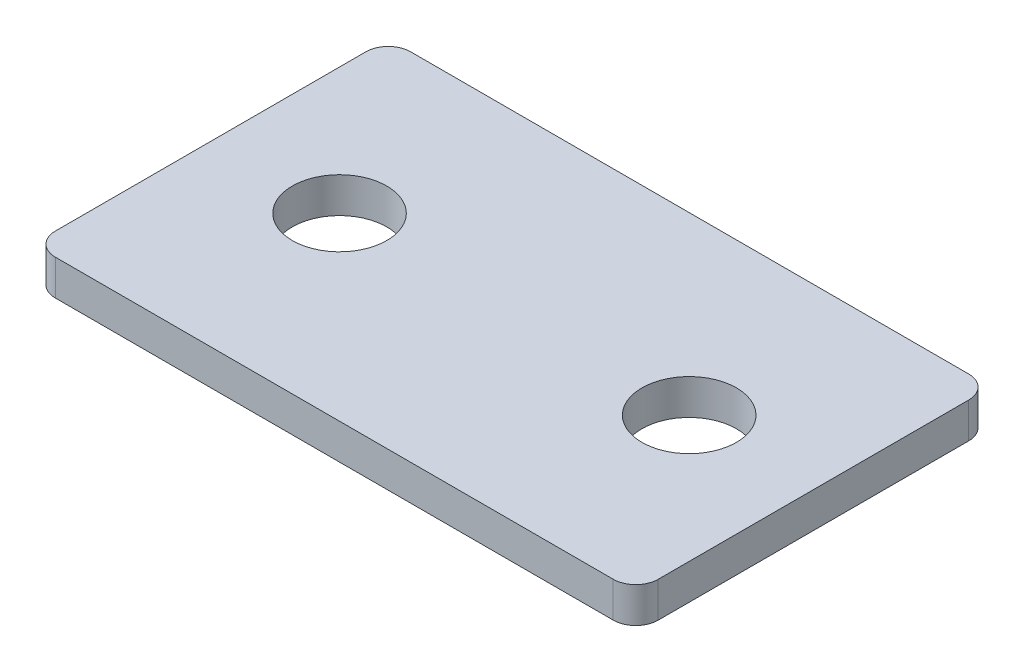
ISO-10303-21;
HEADER;
FILE_DESCRIPTION(('STEP AP214'),'2;1');
FILE_NAME('part.step','',(''),(''),'','','');
FILE_SCHEMA(('AUTOMOTIVE_DESIGN { 1 0 10303 214 1 1 1 1 }'));
ENDSEC;
DATA;
#1=APPLICATION_CONTEXT('core data for automotive mechanical design processes');
#2=APPLICATION_PROTOCOL_DEFINITION('international standard','automotive_design',2000,#1);
#3=PRODUCT_CONTEXT('',#1,'mechanical');
#4=PRODUCT('Part','Part','',(#3));
#5=PRODUCT_RELATED_PRODUCT_CATEGORY('part','',(#4));
#6=PRODUCT_DEFINITION_FORMATION('','',#4);
#7=PRODUCT_DEFINITION_CONTEXT('part definition',#1,'design');
#8=PRODUCT_DEFINITION('design','',#6,#7);
#9=PRODUCT_DEFINITION_SHAPE('','',#8);
#10=(LENGTH_UNIT() NAMED_UNIT(*) SI_UNIT(.MILLI.,.METRE.));
#11=(NAMED_UNIT(*) PLANE_ANGLE_UNIT() SI_UNIT($,.RADIAN.));
#12=(NAMED_UNIT(*) SI_UNIT($,.STERADIAN.) SOLID_ANGLE_UNIT());
#13=UNCERTAINTY_MEASURE_WITH_UNIT(LENGTH_MEASURE(1.E-05),#10,'distance_accuracy_value','');
#14=(GEOMETRIC_REPRESENTATION_CONTEXT(3) GLOBAL_UNCERTAINTY_ASSIGNED_CONTEXT((#13)) GLOBAL_UNIT_ASSIGNED_CONTEXT((#10,
#11,#12)) REPRESENTATION_CONTEXT('',''));
#15=CARTESIAN_POINT('',(0.,0.,0.));
#16=DIRECTION('',(0.,0.,1.));
#17=DIRECTION('',(1.,0.,0.));
#18=AXIS2_PLACEMENT_3D('',#15,#16,#17);
#19=CARTESIAN_POINT('',(-15.748,2.,8.76300000000001));
#20=DIRECTION('',(0.,1.,0.));
#21=DIRECTION('',(0.,0.,1.));
#22=AXIS2_PLACEMENT_3D('',#19,#20,#21);
#23=PLANE('',#22);
#24=CARTESIAN_POINT('',(-9.868,2.,-0.132999999999999));
#25=DIRECTION('',(0.,1.,0.));
#26=DIRECTION('',(0.,0.,1.));
#27=AXIS2_PLACEMENT_3D('',#24,#25,#26);
#28=CIRCLE('',#27,2.667);
#29=CARTESIAN_POINT('',(-9.868,2.,2.534));
#30=VERTEX_POINT('',#29);
#31=EDGE_CURVE('E134',#30,#30,#28,.T.);
#32=ORIENTED_EDGE('',*,*,#31,.F.);
#33=EDGE_LOOP('',(#32));
#34=FACE_BOUND('',#33,.T.);
#35=CARTESIAN_POINT('',(-15.748,2.,8.76300000000001));
#36=DIRECTION('',(0.,1.,0.));
#37=DIRECTION('',(0.,0.,1.));
#38=AXIS2_PLACEMENT_3D('',#35,#36,#37);
#39=CIRCLE('',#38,1.27);
#40=CARTESIAN_POINT('',(-17.018,2.,8.763));
#41=VERTEX_POINT('',#40);
#42=CARTESIAN_POINT('',(-15.748,2.,10.033));
#43=VERTEX_POINT('',#42);
#44=EDGE_CURVE('E145',#41,#43,#39,.T.);
#45=ORIENTED_EDGE('',*,*,#44,.T.);
#46=DIRECTION('',(1.,0.,0.));
#47=VECTOR('',#46,1.);
#48=CARTESIAN_POINT('',(-15.748,2.,10.033));
#49=LINE('',#48,#47);
#50=CARTESIAN_POINT('',(15.748,2.,10.033));
#51=VERTEX_POINT('',#50);
#52=EDGE_CURVE('E93',#43,#51,#49,.T.);
#53=ORIENTED_EDGE('',*,*,#52,.T.);
#54=CARTESIAN_POINT('',(15.748,2.,8.76300000000001));
#55=DIRECTION('',(0.,1.,0.));
#56=DIRECTION('',(0.,0.,1.));
#57=AXIS2_PLACEMENT_3D('',#54,#55,#56);
#58=CIRCLE('',#57,1.27);
#59=CARTESIAN_POINT('',(17.018,2.,8.763));
#60=VERTEX_POINT('',#59);
#61=EDGE_CURVE('E160',#51,#60,#58,.T.);
#62=ORIENTED_EDGE('',*,*,#61,.T.);
#63=DIRECTION('',(0.,0.,-1.));
#64=VECTOR('',#63,1.);
#65=CARTESIAN_POINT('',(17.018,2.,-8.76299999999999));
#66=LINE('',#65,#64);
#67=CARTESIAN_POINT('',(17.018,2.,-8.76299999999999));
#68=VERTEX_POINT('',#67);
#69=EDGE_CURVE('E173',#60,#68,#66,.T.);
#70=ORIENTED_EDGE('',*,*,#69,.T.);
#71=CARTESIAN_POINT('',(15.748,2.,-8.763));
#72=DIRECTION('',(0.,1.,0.));
#73=DIRECTION('',(0.,0.,-1.));
#74=AXIS2_PLACEMENT_3D('',#71,#72,#73);
#75=CIRCLE('',#74,1.27);
#76=CARTESIAN_POINT('',(15.748,2.,-10.033));
#77=VERTEX_POINT('',#76);
#78=EDGE_CURVE('E112',#68,#77,#75,.T.);
#79=ORIENTED_EDGE('',*,*,#78,.T.);
#80=DIRECTION('',(-1.,0.,0.));
#81=VECTOR('',#80,1.);
#82=CARTESIAN_POINT('',(-15.748,2.,-10.033));
#83=LINE('',#82,#81);
#84=CARTESIAN_POINT('',(-15.748,2.,-10.033));
#85=VERTEX_POINT('',#84);
#86=EDGE_CURVE('E106',#77,#85,#83,.T.);
#87=ORIENTED_EDGE('',*,*,#86,.T.);
#88=CARTESIAN_POINT('',(-15.748,2.,-8.763));
#89=DIRECTION('',(0.,1.,0.));
#90=DIRECTION('',(0.,0.,1.));
#91=AXIS2_PLACEMENT_3D('',#88,#89,#90);
#92=CIRCLE('',#91,1.27);
#93=CARTESIAN_POINT('',(-17.018,2.,-8.76299999999999));
#94=VERTEX_POINT('',#93);
#95=EDGE_CURVE('E110',#85,#94,#92,.T.);
#96=ORIENTED_EDGE('',*,*,#95,.T.);
#97=DIRECTION('',(0.,0.,1.));
#98=VECTOR('',#97,1.);
#99=CARTESIAN_POINT('',(-17.018,2.,-8.76299999999999));
#100=LINE('',#99,#98);
#101=EDGE_CURVE('E50',#94,#41,#100,.T.);
#102=ORIENTED_EDGE('',*,*,#101,.T.);
#103=EDGE_LOOP('',(#45,#53,#62,#70,#79,#87,#96,#102));
#104=FACE_BOUND('',#103,.T.);
#105=CARTESIAN_POINT('',(9.86800000000001,2.,-0.132999999999999));
#106=DIRECTION('',(0.,1.,0.));
#107=DIRECTION('',(0.,0.,-1.));
#108=AXIS2_PLACEMENT_3D('',#105,#106,#107);
#109=CIRCLE('',#108,2.667);
#110=CARTESIAN_POINT('',(9.86800000000001,2.,-2.8));
#111=VERTEX_POINT('',#110);
#112=EDGE_CURVE('E182',#111,#111,#109,.T.);
#113=ORIENTED_EDGE('',*,*,#112,.F.);
#114=EDGE_LOOP('',(#113));
#115=FACE_BOUND('',#114,.T.);
#116=ADVANCED_FACE('F33',(#34,#104,#115),#23,.T.);
#117=CARTESIAN_POINT('',(-15.748,0.,8.76300000000001));
#118=DIRECTION('',(0.,1.,0.));
#119=DIRECTION('',(0.,0.,1.));
#120=AXIS2_PLACEMENT_3D('',#117,#118,#119);
#121=PLANE('',#120);
#122=CARTESIAN_POINT('',(-15.748,0.,8.76300000000001));
#123=DIRECTION('',(0.,1.,0.));
#124=DIRECTION('',(0.,0.,1.));
#125=AXIS2_PLACEMENT_3D('',#122,#123,#124);
#126=CIRCLE('',#125,1.27);
#127=CARTESIAN_POINT('',(-17.018,0.,8.763));
#128=VERTEX_POINT('',#127);
#129=CARTESIAN_POINT('',(-15.748,0.,10.033));
#130=VERTEX_POINT('',#129);
#131=EDGE_CURVE('E130',#128,#130,#126,.T.);
#132=ORIENTED_EDGE('',*,*,#131,.F.);
#133=DIRECTION('',(0.,0.,1.));
#134=VECTOR('',#133,1.);
#135=CARTESIAN_POINT('',(-17.018,0.,-8.76299999999999));
#136=LINE('',#135,#134);
#137=CARTESIAN_POINT('',(-17.018,0.,-8.76299999999999));
#138=VERTEX_POINT('',#137);
#139=EDGE_CURVE('E85',#138,#128,#136,.T.);
#140=ORIENTED_EDGE('',*,*,#139,.F.);
#141=CARTESIAN_POINT('',(-15.748,0.,-8.763));
#142=DIRECTION('',(0.,1.,0.));
#143=DIRECTION('',(0.,0.,1.));
#144=AXIS2_PLACEMENT_3D('',#141,#142,#143);
#145=CIRCLE('',#144,1.27);
#146=CARTESIAN_POINT('',(-15.748,0.,-10.033));
#147=VERTEX_POINT('',#146);
#148=EDGE_CURVE('E79',#147,#138,#145,.T.);
#149=ORIENTED_EDGE('',*,*,#148,.F.);
#150=DIRECTION('',(-1.,0.,0.));
#151=VECTOR('',#150,1.);
#152=CARTESIAN_POINT('',(-15.748,0.,-10.033));
#153=LINE('',#152,#151);
#154=CARTESIAN_POINT('',(15.748,0.,-10.033));
#155=VERTEX_POINT('',#154);
#156=EDGE_CURVE('E120',#155,#147,#153,.T.);
#157=ORIENTED_EDGE('',*,*,#156,.F.);
#158=CARTESIAN_POINT('',(15.748,0.,-8.763));
#159=DIRECTION('',(0.,1.,0.));
#160=DIRECTION('',(0.,0.,-1.));
#161=AXIS2_PLACEMENT_3D('',#158,#159,#160);
#162=CIRCLE('',#161,1.27);
#163=CARTESIAN_POINT('',(17.018,0.,-8.76299999999999));
#164=VERTEX_POINT('',#163);
#165=EDGE_CURVE('E140',#164,#155,#162,.T.);
#166=ORIENTED_EDGE('',*,*,#165,.F.);
#167=DIRECTION('',(0.,0.,-1.));
#168=VECTOR('',#167,1.);
#169=CARTESIAN_POINT('',(17.018,0.,-8.76299999999999));
#170=LINE('',#169,#168);
#171=CARTESIAN_POINT('',(17.018,0.,8.763));
#172=VERTEX_POINT('',#171);
#173=EDGE_CURVE('E138',#172,#164,#170,.T.);
#174=ORIENTED_EDGE('',*,*,#173,.F.);
#175=CARTESIAN_POINT('',(15.748,0.,8.76300000000001));
#176=DIRECTION('',(0.,1.,0.));
#177=DIRECTION('',(0.,0.,1.));
#178=AXIS2_PLACEMENT_3D('',#175,#176,#177);
#179=CIRCLE('',#178,1.27);
#180=CARTESIAN_POINT('',(15.748,0.,10.033));
#181=VERTEX_POINT('',#180);
#182=EDGE_CURVE('E136',#181,#172,#179,.T.);
#183=ORIENTED_EDGE('',*,*,#182,.F.);
#184=DIRECTION('',(1.,0.,0.));
#185=VECTOR('',#184,1.);
#186=CARTESIAN_POINT('',(-15.748,0.,10.033));
#187=LINE('',#186,#185);
#188=EDGE_CURVE('E133',#130,#181,#187,.T.);
#189=ORIENTED_EDGE('',*,*,#188,.F.);
#190=EDGE_LOOP('',(#132,#140,#149,#157,#166,#174,#183,#189));
#191=FACE_BOUND('',#190,.T.);
#192=CARTESIAN_POINT('',(-9.868,0.,-0.132999999999999));
#193=DIRECTION('',(0.,1.,0.));
#194=DIRECTION('',(0.,0.,1.));
#195=AXIS2_PLACEMENT_3D('',#192,#193,#194);
#196=CIRCLE('',#195,2.667);
#197=CARTESIAN_POINT('',(-9.868,0.,2.534));
#198=VERTEX_POINT('',#197);
#199=EDGE_CURVE('E179',#198,#198,#196,.T.);
#200=ORIENTED_EDGE('',*,*,#199,.T.);
#201=EDGE_LOOP('',(#200));
#202=FACE_BOUND('',#201,.T.);
#203=CARTESIAN_POINT('',(9.86800000000001,0.,-0.132999999999999));
#204=DIRECTION('',(0.,1.,0.));
#205=DIRECTION('',(0.,0.,-1.));
#206=AXIS2_PLACEMENT_3D('',#203,#204,#205);
#207=CIRCLE('',#206,2.667);
#208=CARTESIAN_POINT('',(9.86800000000001,0.,-2.8));
#209=VERTEX_POINT('',#208);
#210=EDGE_CURVE('E185',#209,#209,#207,.T.);
#211=ORIENTED_EDGE('',*,*,#210,.T.);
#212=EDGE_LOOP('',(#211));
#213=FACE_BOUND('',#212,.T.);
#214=ADVANCED_FACE('F164',(#191,#202,#213),#121,.F.);
#215=CARTESIAN_POINT('',(-15.748,2.,8.76300000000001));
#216=DIRECTION('',(0.,-1.,0.));
#217=DIRECTION('',(0.,0.,-1.));
#218=AXIS2_PLACEMENT_3D('',#215,#216,#217);
#219=CYLINDRICAL_SURFACE('',#218,1.27);
#220=ORIENTED_EDGE('',*,*,#131,.T.);
#221=DIRECTION('',(0.,-1.,0.));
#222=VECTOR('',#221,1.);
#223=CARTESIAN_POINT('',(-15.748,2.,10.033));
#224=LINE('',#223,#222);
#225=EDGE_CURVE('E11',#43,#130,#224,.T.);
#226=ORIENTED_EDGE('',*,*,#225,.F.);
#227=ORIENTED_EDGE('',*,*,#44,.F.);
#228=DIRECTION('',(0.,-1.,0.));
#229=VECTOR('',#228,1.);
#230=CARTESIAN_POINT('',(-17.018,2.,8.763));
#231=LINE('',#230,#229);
#232=EDGE_CURVE('E126',#41,#128,#231,.T.);
#233=ORIENTED_EDGE('',*,*,#232,.T.);
#234=EDGE_LOOP('',(#220,#226,#227,#233));
#235=FACE_BOUND('',#234,.T.);
#236=ADVANCED_FACE('F35',(#235),#219,.T.);
#237=CARTESIAN_POINT('',(-15.748,2.,10.033));
#238=DIRECTION('',(0.,0.,-1.));
#239=DIRECTION('',(-1.,0.,0.));
#240=AXIS2_PLACEMENT_3D('',#237,#238,#239);
#241=PLANE('',#240);
#242=ORIENTED_EDGE('',*,*,#188,.T.);
#243=DIRECTION('',(0.,-1.,0.));
#244=VECTOR('',#243,1.);
#245=CARTESIAN_POINT('',(15.748,2.,10.033));
#246=LINE('',#245,#244);
#247=EDGE_CURVE('E42',#51,#181,#246,.T.);
#248=ORIENTED_EDGE('',*,*,#247,.F.);
#249=ORIENTED_EDGE('',*,*,#52,.F.);
#250=ORIENTED_EDGE('',*,*,#225,.T.);
#251=EDGE_LOOP('',(#242,#248,#249,#250));
#252=FACE_BOUND('',#251,.T.);
#253=ADVANCED_FACE('F217',(#252),#241,.F.);
#254=CARTESIAN_POINT('',(15.748,2.,8.76300000000001));
#255=DIRECTION('',(0.,-1.,0.));
#256=DIRECTION('',(0.,0.,-1.));
#257=AXIS2_PLACEMENT_3D('',#254,#255,#256);
#258=CYLINDRICAL_SURFACE('',#257,1.27);
#259=ORIENTED_EDGE('',*,*,#182,.T.);
#260=DIRECTION('',(0.,-1.,0.));
#261=VECTOR('',#260,1.);
#262=CARTESIAN_POINT('',(17.018,2.,8.763));
#263=LINE('',#262,#261);
#264=EDGE_CURVE('E152',#60,#172,#263,.T.);
#265=ORIENTED_EDGE('',*,*,#264,.F.);
#266=ORIENTED_EDGE('',*,*,#61,.F.);
#267=ORIENTED_EDGE('',*,*,#247,.T.);
#268=EDGE_LOOP('',(#259,#265,#266,#267));
#269=FACE_BOUND('',#268,.T.);
#270=ADVANCED_FACE('F158',(#269),#258,.T.);
#271=CARTESIAN_POINT('',(17.018,2.,-8.76299999999999));
#272=DIRECTION('',(-1.,0.,0.));
#273=DIRECTION('',(0.,0.,1.));
#274=AXIS2_PLACEMENT_3D('',#271,#272,#273);
#275=PLANE('',#274);
#276=ORIENTED_EDGE('',*,*,#173,.T.);
#277=DIRECTION('',(0.,-1.,0.));
#278=VECTOR('',#277,1.);
#279=CARTESIAN_POINT('',(17.018,2.,-8.76299999999999));
#280=LINE('',#279,#278);
#281=EDGE_CURVE('E149',#68,#164,#280,.T.);
#282=ORIENTED_EDGE('',*,*,#281,.F.);
#283=ORIENTED_EDGE('',*,*,#69,.F.);
#284=ORIENTED_EDGE('',*,*,#264,.T.);
#285=EDGE_LOOP('',(#276,#282,#283,#284));
#286=FACE_BOUND('',#285,.T.);
#287=ADVANCED_FACE('F169',(#286),#275,.F.);
#288=CARTESIAN_POINT('',(15.748,2.,-8.763));
#289=DIRECTION('',(0.,-1.,0.));
#290=DIRECTION('',(0.,0.,-1.));
#291=AXIS2_PLACEMENT_3D('',#288,#289,#290);
#292=CYLINDRICAL_SURFACE('',#291,1.27);
#293=ORIENTED_EDGE('',*,*,#165,.T.);
#294=DIRECTION('',(0.,-1.,0.));
#295=VECTOR('',#294,1.);
#296=CARTESIAN_POINT('',(15.748,2.,-10.033));
#297=LINE('',#296,#295);
#298=EDGE_CURVE('E121',#77,#155,#297,.T.);
#299=ORIENTED_EDGE('',*,*,#298,.F.);
#300=ORIENTED_EDGE('',*,*,#78,.F.);
#301=ORIENTED_EDGE('',*,*,#281,.T.);
#302=EDGE_LOOP('',(#293,#299,#300,#301));
#303=FACE_BOUND('',#302,.T.);
#304=ADVANCED_FACE('F172',(#303),#292,.T.);
#305=CARTESIAN_POINT('',(-15.748,2.,-10.033));
#306=DIRECTION('',(0.,0.,1.));
#307=DIRECTION('',(1.,0.,0.));
#308=AXIS2_PLACEMENT_3D('',#305,#306,#307);
#309=PLANE('',#308);
#310=ORIENTED_EDGE('',*,*,#156,.T.);
#311=DIRECTION('',(0.,-1.,0.));
#312=VECTOR('',#311,1.);
#313=CARTESIAN_POINT('',(-15.748,2.,-10.033));
#314=LINE('',#313,#312);
#315=EDGE_CURVE('E117',#85,#147,#314,.T.);
#316=ORIENTED_EDGE('',*,*,#315,.F.);
#317=ORIENTED_EDGE('',*,*,#86,.F.);
#318=ORIENTED_EDGE('',*,*,#298,.T.);
#319=EDGE_LOOP('',(#310,#316,#317,#318));
#320=FACE_BOUND('',#319,.T.);
#321=ADVANCED_FACE('F118',(#320),#309,.F.);
#322=CARTESIAN_POINT('',(-15.748,2.,-8.763));
#323=DIRECTION('',(0.,-1.,0.));
#324=DIRECTION('',(0.,0.,-1.));
#325=AXIS2_PLACEMENT_3D('',#322,#323,#324);
#326=CYLINDRICAL_SURFACE('',#325,1.27);
#327=ORIENTED_EDGE('',*,*,#148,.T.);
#328=DIRECTION('',(0.,-1.,0.));
#329=VECTOR('',#328,1.);
#330=CARTESIAN_POINT('',(-17.018,2.,-8.76299999999999));
#331=LINE('',#330,#329);
#332=EDGE_CURVE('E122',#94,#138,#331,.T.);
#333=ORIENTED_EDGE('',*,*,#332,.F.);
#334=ORIENTED_EDGE('',*,*,#95,.F.);
#335=ORIENTED_EDGE('',*,*,#315,.T.);
#336=EDGE_LOOP('',(#327,#333,#334,#335));
#337=FACE_BOUND('',#336,.T.);
#338=ADVANCED_FACE('F124',(#337),#326,.T.);
#339=CARTESIAN_POINT('',(-17.018,2.,-8.76299999999999));
#340=DIRECTION('',(1.,0.,0.));
#341=DIRECTION('',(0.,0.,-1.));
#342=AXIS2_PLACEMENT_3D('',#339,#340,#341);
#343=PLANE('',#342);
#344=ORIENTED_EDGE('',*,*,#139,.T.);
#345=ORIENTED_EDGE('',*,*,#232,.F.);
#346=ORIENTED_EDGE('',*,*,#101,.F.);
#347=ORIENTED_EDGE('',*,*,#332,.T.);
#348=EDGE_LOOP('',(#344,#345,#346,#347));
#349=FACE_BOUND('',#348,.T.);
#350=ADVANCED_FACE('F205',(#349),#343,.F.);
#351=CARTESIAN_POINT('',(-9.868,2.,-0.132999999999999));
#352=DIRECTION('',(0.,-1.,0.));
#353=DIRECTION('',(0.,0.,-1.));
#354=AXIS2_PLACEMENT_3D('',#351,#352,#353);
#355=CYLINDRICAL_SURFACE('',#354,2.667);
#356=ORIENTED_EDGE('',*,*,#31,.T.);
#357=EDGE_LOOP('',(#356));
#358=FACE_BOUND('',#357,.T.);
#359=ORIENTED_EDGE('',*,*,#199,.F.);
#360=EDGE_LOOP('',(#359));
#361=FACE_BOUND('',#360,.T.);
#362=ADVANCED_FACE('F202',(#358,#361),#355,.F.);
#363=CARTESIAN_POINT('',(9.86800000000001,2.,-0.132999999999999));
#364=DIRECTION('',(0.,-1.,0.));
#365=DIRECTION('',(0.,0.,-1.));
#366=AXIS2_PLACEMENT_3D('',#363,#364,#365);
#367=CYLINDRICAL_SURFACE('',#366,2.667);
#368=ORIENTED_EDGE('',*,*,#112,.T.);
#369=EDGE_LOOP('',(#368));
#370=FACE_BOUND('',#369,.T.);
#371=ORIENTED_EDGE('',*,*,#210,.F.);
#372=EDGE_LOOP('',(#371));
#373=FACE_BOUND('',#372,.T.);
#374=ADVANCED_FACE('F191',(#370,#373),#367,.F.);
#375=CLOSED_SHELL('',(#116,#214,#236,#253,#270,#287,#304,#321,#338,#350,#362,#374));
#376=MANIFOLD_SOLID_BREP('B2',#375);
#377=ADVANCED_BREP_SHAPE_REPRESENTATION('',(#18,#376),#14);
#378=SHAPE_DEFINITION_REPRESENTATION(#9,#377);
ENDSEC;
END-ISO-10303-21;
